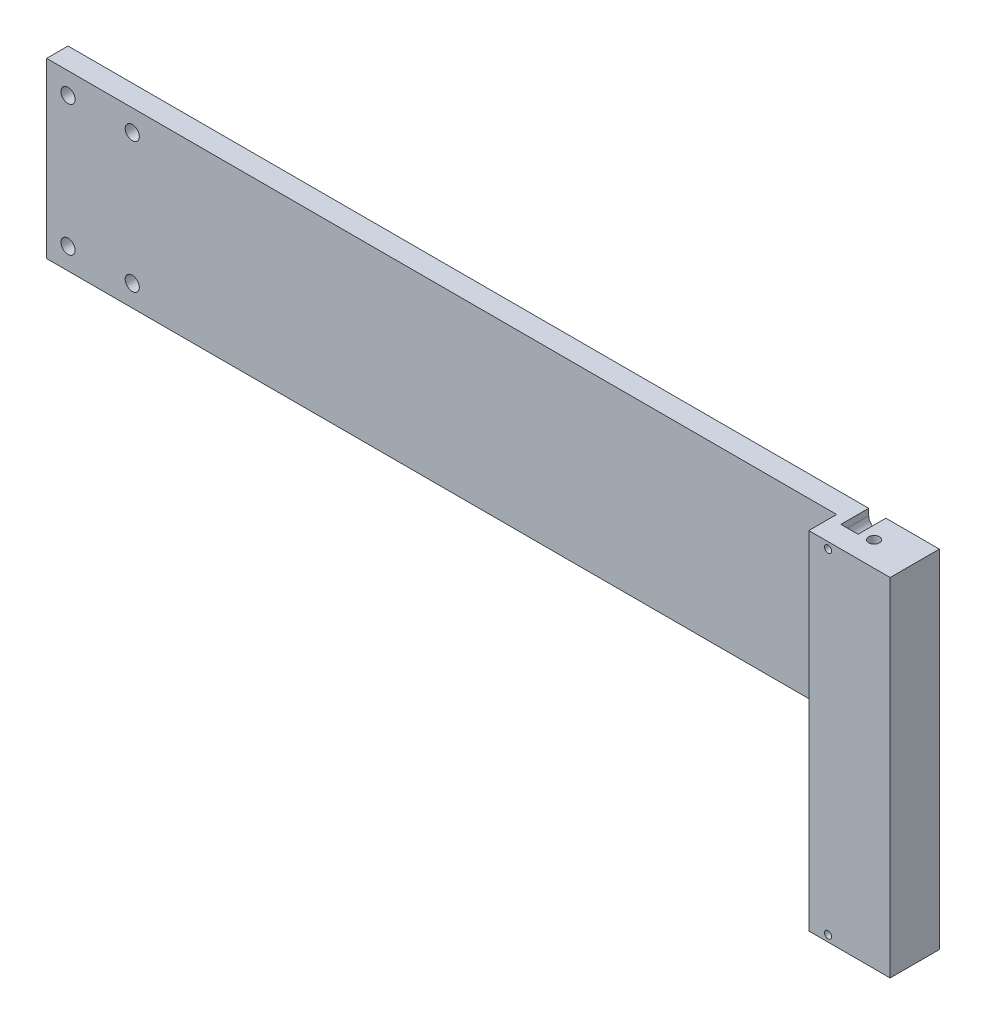
ISO-10303-21;
HEADER;
FILE_DESCRIPTION(('STEP AP214'),'2;1');
FILE_NAME('part.step','',(''),(''),'','','');
FILE_SCHEMA(('AUTOMOTIVE_DESIGN { 1 0 10303 214 1 1 1 1 }'));
ENDSEC;
DATA;
#1=APPLICATION_CONTEXT('core data for automotive mechanical design processes');
#2=APPLICATION_PROTOCOL_DEFINITION('international standard','automotive_design',2000,#1);
#3=PRODUCT_CONTEXT('',#1,'mechanical');
#4=PRODUCT('Part','Part','',(#3));
#5=PRODUCT_RELATED_PRODUCT_CATEGORY('part','',(#4));
#6=PRODUCT_DEFINITION_FORMATION('','',#4);
#7=PRODUCT_DEFINITION_CONTEXT('part definition',#1,'design');
#8=PRODUCT_DEFINITION('design','',#6,#7);
#9=PRODUCT_DEFINITION_SHAPE('','',#8);
#10=(LENGTH_UNIT() NAMED_UNIT(*) SI_UNIT(.MILLI.,.METRE.));
#11=(NAMED_UNIT(*) PLANE_ANGLE_UNIT() SI_UNIT($,.RADIAN.));
#12=(NAMED_UNIT(*) SI_UNIT($,.STERADIAN.) SOLID_ANGLE_UNIT());
#13=UNCERTAINTY_MEASURE_WITH_UNIT(LENGTH_MEASURE(1.E-05),#10,'distance_accuracy_value','');
#14=(GEOMETRIC_REPRESENTATION_CONTEXT(3) GLOBAL_UNCERTAINTY_ASSIGNED_CONTEXT((#13)) GLOBAL_UNIT_ASSIGNED_CONTEXT((#10,
#11,#12)) REPRESENTATION_CONTEXT('',''));
#15=CARTESIAN_POINT('',(0.,0.,0.));
#16=DIRECTION('',(0.,0.,1.));
#17=DIRECTION('',(1.,0.,0.));
#18=AXIS2_PLACEMENT_3D('',#15,#16,#17);
#19=CARTESIAN_POINT('',(378.,78.,23.));
#20=DIRECTION('',(0.,0.,-1.));
#21=DIRECTION('',(-1.,0.,0.));
#22=AXIS2_PLACEMENT_3D('',#19,#20,#21);
#23=CYLINDRICAL_SURFACE('',#22,1.64999999999999);
#24=CARTESIAN_POINT('',(378.,78.,23.));
#25=DIRECTION('',(0.,0.,-1.));
#26=DIRECTION('',(-1.,0.,0.));
#27=AXIS2_PLACEMENT_3D('',#24,#25,#26);
#28=CIRCLE('',#27,1.64999999999999);
#29=CARTESIAN_POINT('',(376.35,78.,23.));
#30=VERTEX_POINT('',#29);
#31=EDGE_CURVE('E228',#30,#30,#28,.T.);
#32=ORIENTED_EDGE('',*,*,#31,.F.);
#33=EDGE_LOOP('',(#32));
#34=FACE_BOUND('',#33,.T.);
#35=CARTESIAN_POINT('',(378.,78.,13.));
#36=DIRECTION('',(0.,0.,-1.));
#37=DIRECTION('',(-1.,0.,0.));
#38=AXIS2_PLACEMENT_3D('',#35,#36,#37);
#39=CIRCLE('',#38,1.64999999999999);
#40=CARTESIAN_POINT('',(376.35,78.,13.));
#41=VERTEX_POINT('',#40);
#42=EDGE_CURVE('E57',#41,#41,#39,.F.);
#43=ORIENTED_EDGE('',*,*,#42,.F.);
#44=EDGE_LOOP('',(#43));
#45=FACE_BOUND('',#44,.T.);
#46=ADVANCED_FACE('F53',(#34,#45),#23,.F.);
#47=CARTESIAN_POINT('',(378.,-78.,23.));
#48=DIRECTION('',(0.,0.,-1.));
#49=DIRECTION('',(-1.,0.,0.));
#50=AXIS2_PLACEMENT_3D('',#47,#48,#49);
#51=CYLINDRICAL_SURFACE('',#50,1.64999999999999);
#52=CARTESIAN_POINT('',(378.,-78.,23.));
#53=DIRECTION('',(0.,0.,-1.));
#54=DIRECTION('',(-1.,0.,0.));
#55=AXIS2_PLACEMENT_3D('',#52,#53,#54);
#56=CIRCLE('',#55,1.64999999999999);
#57=CARTESIAN_POINT('',(376.35,-78.,23.));
#58=VERTEX_POINT('',#57);
#59=EDGE_CURVE('E224',#58,#58,#56,.T.);
#60=ORIENTED_EDGE('',*,*,#59,.F.);
#61=EDGE_LOOP('',(#60));
#62=FACE_BOUND('',#61,.T.);
#63=CARTESIAN_POINT('',(378.,-78.,13.));
#64=DIRECTION('',(0.,0.,-1.));
#65=DIRECTION('',(-1.,0.,0.));
#66=AXIS2_PLACEMENT_3D('',#63,#64,#65);
#67=CIRCLE('',#66,1.64999999999999);
#68=CARTESIAN_POINT('',(376.35,-78.,13.));
#69=VERTEX_POINT('',#68);
#70=EDGE_CURVE('E195',#69,#69,#67,.F.);
#71=ORIENTED_EDGE('',*,*,#70,.F.);
#72=EDGE_LOOP('',(#71));
#73=FACE_BOUND('',#72,.T.);
#74=ADVANCED_FACE('F321',(#62,#73),#51,.F.);
#75=CARTESIAN_POINT('',(0.,0.,10.));
#76=DIRECTION('',(1.,0.,0.));
#77=DIRECTION('',(0.,0.,-1.));
#78=AXIS2_PLACEMENT_3D('',#75,#76,#77);
#79=PLANE('',#78);
#80=DIRECTION('',(0.,-1.,0.));
#81=VECTOR('',#80,1.);
#82=CARTESIAN_POINT('',(0.,0.,0.));
#83=LINE('',#82,#81);
#84=CARTESIAN_POINT('',(0.,81.,0.));
#85=VERTEX_POINT('',#84);
#86=CARTESIAN_POINT('',(0.,0.,0.));
#87=VERTEX_POINT('',#86);
#88=EDGE_CURVE('E291',#85,#87,#83,.T.);
#89=ORIENTED_EDGE('',*,*,#88,.T.);
#90=DIRECTION('',(0.,0.,-1.));
#91=VECTOR('',#90,1.);
#92=CARTESIAN_POINT('',(0.,0.,10.));
#93=LINE('',#92,#91);
#94=CARTESIAN_POINT('',(0.,0.,10.));
#95=VERTEX_POINT('',#94);
#96=EDGE_CURVE('E13',#95,#87,#93,.T.);
#97=ORIENTED_EDGE('',*,*,#96,.F.);
#98=DIRECTION('',(0.,-1.,0.));
#99=VECTOR('',#98,1.);
#100=CARTESIAN_POINT('',(0.,0.,10.));
#101=LINE('',#100,#99);
#102=CARTESIAN_POINT('',(0.,81.,10.));
#103=VERTEX_POINT('',#102);
#104=EDGE_CURVE('E292',#103,#95,#101,.T.);
#105=ORIENTED_EDGE('',*,*,#104,.F.);
#106=DIRECTION('',(0.,0.,-1.));
#107=VECTOR('',#106,1.);
#108=CARTESIAN_POINT('',(0.,81.,10.));
#109=LINE('',#108,#107);
#110=EDGE_CURVE('E302',#103,#85,#109,.T.);
#111=ORIENTED_EDGE('',*,*,#110,.T.);
#112=EDGE_LOOP('',(#89,#97,#105,#111));
#113=FACE_BOUND('',#112,.T.);
#114=ADVANCED_FACE('F55',(#113),#79,.F.);
#115=CARTESIAN_POINT('',(0.,0.,10.));
#116=DIRECTION('',(0.,1.,0.));
#117=DIRECTION('',(0.,0.,1.));
#118=AXIS2_PLACEMENT_3D('',#115,#116,#117);
#119=PLANE('',#118);
#120=DIRECTION('',(1.,0.,0.));
#121=VECTOR('',#120,1.);
#122=CARTESIAN_POINT('',(0.,0.,0.));
#123=LINE('',#122,#121);
#124=CARTESIAN_POINT('',(369.,0.,0.));
#125=VERTEX_POINT('',#124);
#126=EDGE_CURVE('E305',#87,#125,#123,.T.);
#127=ORIENTED_EDGE('',*,*,#126,.T.);
#128=DIRECTION('',(0.,0.,-1.));
#129=VECTOR('',#128,1.);
#130=CARTESIAN_POINT('',(369.,0.,10.));
#131=LINE('',#130,#129);
#132=CARTESIAN_POINT('',(369.,0.,10.));
#133=VERTEX_POINT('',#132);
#134=EDGE_CURVE('E62',#133,#125,#131,.T.);
#135=ORIENTED_EDGE('',*,*,#134,.F.);
#136=DIRECTION('',(1.,0.,0.));
#137=VECTOR('',#136,1.);
#138=CARTESIAN_POINT('',(0.,0.,10.));
#139=LINE('',#138,#137);
#140=EDGE_CURVE('E295',#95,#133,#139,.T.);
#141=ORIENTED_EDGE('',*,*,#140,.F.);
#142=ORIENTED_EDGE('',*,*,#96,.T.);
#143=EDGE_LOOP('',(#127,#135,#141,#142));
#144=FACE_BOUND('',#143,.T.);
#145=ADVANCED_FACE('F378',(#144),#119,.F.);
#146=CARTESIAN_POINT('',(0.,81.,10.));
#147=DIRECTION('',(0.,-1.,0.));
#148=DIRECTION('',(0.,0.,-1.));
#149=AXIS2_PLACEMENT_3D('',#146,#147,#148);
#150=PLANE('',#149);
#151=DIRECTION('',(-1.,0.,0.));
#152=VECTOR('',#151,1.);
#153=CARTESIAN_POINT('',(0.,81.,0.));
#154=LINE('',#153,#152);
#155=CARTESIAN_POINT('',(407.,81.,0.));
#156=VERTEX_POINT('',#155);
#157=CARTESIAN_POINT('',(382.,81.,0.));
#158=VERTEX_POINT('',#157);
#159=EDGE_CURVE('E296',#156,#158,#154,.T.);
#160=ORIENTED_EDGE('',*,*,#159,.T.);
#161=DIRECTION('',(0.,0.,-1.));
#162=VECTOR('',#161,1.);
#163=CARTESIAN_POINT('',(382.,81.,13.));
#164=LINE('',#163,#162);
#165=CARTESIAN_POINT('',(382.,81.,13.));
#166=VERTEX_POINT('',#165);
#167=EDGE_CURVE('E218',#166,#158,#164,.T.);
#168=ORIENTED_EDGE('',*,*,#167,.F.);
#169=DIRECTION('',(1.,0.,0.));
#170=VECTOR('',#169,1.);
#171=CARTESIAN_POINT('',(374.,81.,13.));
#172=LINE('',#171,#170);
#173=CARTESIAN_POINT('',(374.,81.,13.));
#174=VERTEX_POINT('',#173);
#175=EDGE_CURVE('E206',#174,#166,#172,.T.);
#176=ORIENTED_EDGE('',*,*,#175,.F.);
#177=DIRECTION('',(0.,0.,-1.));
#178=VECTOR('',#177,1.);
#179=CARTESIAN_POINT('',(374.,81.,13.));
#180=LINE('',#179,#178);
#181=CARTESIAN_POINT('',(374.,81.,0.));
#182=VERTEX_POINT('',#181);
#183=EDGE_CURVE('E220',#174,#182,#180,.T.);
#184=ORIENTED_EDGE('',*,*,#183,.T.);
#185=EDGE_CURVE('E307',#182,#85,#154,.T.);
#186=ORIENTED_EDGE('',*,*,#185,.T.);
#187=ORIENTED_EDGE('',*,*,#110,.F.);
#188=DIRECTION('',(-1.,0.,0.));
#189=VECTOR('',#188,1.);
#190=CARTESIAN_POINT('',(0.,81.,10.));
#191=LINE('',#190,#189);
#192=CARTESIAN_POINT('',(369.,81.,10.));
#193=VERTEX_POINT('',#192);
#194=EDGE_CURVE('E300',#193,#103,#191,.T.);
#195=ORIENTED_EDGE('',*,*,#194,.F.);
#196=DIRECTION('',(0.,0.,1.));
#197=VECTOR('',#196,1.);
#198=CARTESIAN_POINT('',(369.,81.,23.));
#199=LINE('',#198,#197);
#200=CARTESIAN_POINT('',(369.,81.,23.));
#201=VERTEX_POINT('',#200);
#202=EDGE_CURVE('E265',#193,#201,#199,.T.);
#203=ORIENTED_EDGE('',*,*,#202,.T.);
#204=DIRECTION('',(-1.,0.,0.));
#205=VECTOR('',#204,1.);
#206=CARTESIAN_POINT('',(407.,81.,23.));
#207=LINE('',#206,#205);
#208=CARTESIAN_POINT('',(407.,81.,23.));
#209=VERTEX_POINT('',#208);
#210=EDGE_CURVE('E272',#209,#201,#207,.T.);
#211=ORIENTED_EDGE('',*,*,#210,.F.);
#212=DIRECTION('',(0.,0.,1.));
#213=VECTOR('',#212,1.);
#214=CARTESIAN_POINT('',(407.,81.,23.));
#215=LINE('',#214,#213);
#216=EDGE_CURVE('E270',#156,#209,#215,.T.);
#217=ORIENTED_EDGE('',*,*,#216,.F.);
#218=EDGE_LOOP('',(#160,#168,#176,#184,#186,#187,#195,#203,#211,#217));
#219=FACE_BOUND('',#218,.T.);
#220=CARTESIAN_POINT('',(388.,81.,11.5));
#221=DIRECTION('',(0.,1.,0.));
#222=DIRECTION('',(0.,0.,1.));
#223=AXIS2_PLACEMENT_3D('',#220,#221,#222);
#224=CIRCLE('',#223,2.50000000000002);
#225=CARTESIAN_POINT('',(388.,81.,14.));
#226=VERTEX_POINT('',#225);
#227=EDGE_CURVE('E227',#226,#226,#224,.T.);
#228=ORIENTED_EDGE('',*,*,#227,.F.);
#229=EDGE_LOOP('',(#228));
#230=FACE_BOUND('',#229,.T.);
#231=ADVANCED_FACE('F372',(#219,#230),#150,.F.);
#232=CARTESIAN_POINT('',(0.,0.,10.));
#233=DIRECTION('',(0.,0.,-1.));
#234=DIRECTION('',(-1.,0.,0.));
#235=AXIS2_PLACEMENT_3D('',#232,#233,#234);
#236=PLANE('',#235);
#237=CARTESIAN_POINT('',(40.,71.,10.));
#238=DIRECTION('',(0.,0.,-1.));
#239=DIRECTION('',(-1.,0.,0.));
#240=AXIS2_PLACEMENT_3D('',#237,#238,#239);
#241=CIRCLE('',#240,3.3);
#242=CARTESIAN_POINT('',(36.7,71.,10.));
#243=VERTEX_POINT('',#242);
#244=EDGE_CURVE('E257',#243,#243,#241,.T.);
#245=ORIENTED_EDGE('',*,*,#244,.T.);
#246=EDGE_LOOP('',(#245));
#247=FACE_BOUND('',#246,.T.);
#248=CARTESIAN_POINT('',(40.,10.,10.));
#249=DIRECTION('',(0.,0.,-1.));
#250=DIRECTION('',(-1.,0.,0.));
#251=AXIS2_PLACEMENT_3D('',#248,#249,#250);
#252=CIRCLE('',#251,3.3);
#253=CARTESIAN_POINT('',(36.7,10.,10.));
#254=VERTEX_POINT('',#253);
#255=EDGE_CURVE('E254',#254,#254,#252,.T.);
#256=ORIENTED_EDGE('',*,*,#255,.T.);
#257=EDGE_LOOP('',(#256));
#258=FACE_BOUND('',#257,.T.);
#259=CARTESIAN_POINT('',(10.,10.,10.));
#260=DIRECTION('',(0.,0.,-1.));
#261=DIRECTION('',(-1.,0.,0.));
#262=AXIS2_PLACEMENT_3D('',#259,#260,#261);
#263=CIRCLE('',#262,3.3);
#264=CARTESIAN_POINT('',(6.70000000000001,10.,10.));
#265=VERTEX_POINT('',#264);
#266=EDGE_CURVE('E251',#265,#265,#263,.T.);
#267=ORIENTED_EDGE('',*,*,#266,.T.);
#268=EDGE_LOOP('',(#267));
#269=FACE_BOUND('',#268,.T.);
#270=CARTESIAN_POINT('',(10.,71.,10.));
#271=DIRECTION('',(0.,0.,-1.));
#272=DIRECTION('',(-1.,0.,0.));
#273=AXIS2_PLACEMENT_3D('',#270,#271,#272);
#274=CIRCLE('',#273,3.3);
#275=CARTESIAN_POINT('',(6.70000000000001,71.,10.));
#276=VERTEX_POINT('',#275);
#277=EDGE_CURVE('E248',#276,#276,#274,.T.);
#278=ORIENTED_EDGE('',*,*,#277,.T.);
#279=EDGE_LOOP('',(#278));
#280=FACE_BOUND('',#279,.T.);
#281=ORIENTED_EDGE('',*,*,#104,.T.);
#282=ORIENTED_EDGE('',*,*,#140,.T.);
#283=DIRECTION('',(0.,1.,0.));
#284=VECTOR('',#283,1.);
#285=CARTESIAN_POINT('',(369.,0.,10.));
#286=LINE('',#285,#284);
#287=EDGE_CURVE('E298',#133,#193,#286,.T.);
#288=ORIENTED_EDGE('',*,*,#287,.T.);
#289=ORIENTED_EDGE('',*,*,#194,.T.);
#290=EDGE_LOOP('',(#281,#282,#288,#289));
#291=FACE_BOUND('',#290,.T.);
#292=ADVANCED_FACE('F369',(#247,#258,#269,#280,#291),#236,.F.);
#293=CARTESIAN_POINT('',(0.,0.,0.));
#294=DIRECTION('',(0.,0.,-1.));
#295=DIRECTION('',(-1.,0.,0.));
#296=AXIS2_PLACEMENT_3D('',#293,#294,#295);
#297=PLANE('',#296);
#298=DIRECTION('',(0.,1.,0.));
#299=VECTOR('',#298,1.);
#300=CARTESIAN_POINT('',(374.,-81.,0.));
#301=LINE('',#300,#299);
#302=CARTESIAN_POINT('',(374.,-81.,0.));
#303=VERTEX_POINT('',#302);
#304=CARTESIAN_POINT('',(374.,-78.,0.));
#305=VERTEX_POINT('',#304);
#306=EDGE_CURVE('E182',#303,#305,#301,.T.);
#307=ORIENTED_EDGE('',*,*,#306,.F.);
#308=DIRECTION('',(-1.,0.,0.));
#309=VECTOR('',#308,1.);
#310=CARTESIAN_POINT('',(407.,-81.,0.));
#311=LINE('',#310,#309);
#312=CARTESIAN_POINT('',(369.,-81.,0.));
#313=VERTEX_POINT('',#312);
#314=EDGE_CURVE('E284',#303,#313,#311,.T.);
#315=ORIENTED_EDGE('',*,*,#314,.T.);
#316=DIRECTION('',(0.,1.,0.));
#317=VECTOR('',#316,1.);
#318=CARTESIAN_POINT('',(369.,81.,0.));
#319=LINE('',#318,#317);
#320=EDGE_CURVE('E278',#313,#125,#319,.T.);
#321=ORIENTED_EDGE('',*,*,#320,.T.);
#322=ORIENTED_EDGE('',*,*,#126,.F.);
#323=ORIENTED_EDGE('',*,*,#88,.F.);
#324=ORIENTED_EDGE('',*,*,#185,.F.);
#325=DIRECTION('',(0.,1.,0.));
#326=VECTOR('',#325,1.);
#327=CARTESIAN_POINT('',(374.,78.,0.));
#328=LINE('',#327,#326);
#329=CARTESIAN_POINT('',(374.,78.,0.));
#330=VERTEX_POINT('',#329);
#331=EDGE_CURVE('E213',#330,#182,#328,.T.);
#332=ORIENTED_EDGE('',*,*,#331,.F.);
#333=CARTESIAN_POINT('',(378.,78.,0.));
#334=DIRECTION('',(0.,0.,-1.));
#335=DIRECTION('',(-1.,0.,0.));
#336=AXIS2_PLACEMENT_3D('',#333,#334,#335);
#337=CIRCLE('',#336,4.);
#338=CARTESIAN_POINT('',(382.,78.,0.));
#339=VERTEX_POINT('',#338);
#340=EDGE_CURVE('E70',#339,#330,#337,.T.);
#341=ORIENTED_EDGE('',*,*,#340,.F.);
#342=DIRECTION('',(0.,-1.,0.));
#343=VECTOR('',#342,1.);
#344=CARTESIAN_POINT('',(382.,81.,0.));
#345=LINE('',#344,#343);
#346=EDGE_CURVE('E203',#158,#339,#345,.T.);
#347=ORIENTED_EDGE('',*,*,#346,.F.);
#348=ORIENTED_EDGE('',*,*,#159,.F.);
#349=DIRECTION('',(0.,1.,0.));
#350=VECTOR('',#349,1.);
#351=CARTESIAN_POINT('',(407.,81.,0.));
#352=LINE('',#351,#350);
#353=CARTESIAN_POINT('',(407.,-81.,0.));
#354=VERTEX_POINT('',#353);
#355=EDGE_CURVE('E267',#354,#156,#352,.T.);
#356=ORIENTED_EDGE('',*,*,#355,.F.);
#357=CARTESIAN_POINT('',(382.,-81.,0.));
#358=VERTEX_POINT('',#357);
#359=EDGE_CURVE('E285',#354,#358,#311,.T.);
#360=ORIENTED_EDGE('',*,*,#359,.T.);
#361=DIRECTION('',(0.,-1.,0.));
#362=VECTOR('',#361,1.);
#363=CARTESIAN_POINT('',(382.,-78.,0.));
#364=LINE('',#363,#362);
#365=CARTESIAN_POINT('',(382.,-78.,0.));
#366=VERTEX_POINT('',#365);
#367=EDGE_CURVE('E185',#366,#358,#364,.T.);
#368=ORIENTED_EDGE('',*,*,#367,.F.);
#369=CARTESIAN_POINT('',(378.,-78.,0.));
#370=DIRECTION('',(0.,0.,-1.));
#371=DIRECTION('',(-1.,0.,0.));
#372=AXIS2_PLACEMENT_3D('',#369,#370,#371);
#373=CIRCLE('',#372,4.);
#374=EDGE_CURVE('E168',#305,#366,#373,.T.);
#375=ORIENTED_EDGE('',*,*,#374,.F.);
#376=EDGE_LOOP('',(#307,#315,#321,#322,#323,#324,#332,#341,#347,#348,#356,#360,#368,#375));
#377=FACE_BOUND('',#376,.T.);
#378=CARTESIAN_POINT('',(40.,71.,0.));
#379=DIRECTION('',(0.,0.,-1.));
#380=DIRECTION('',(-1.,0.,0.));
#381=AXIS2_PLACEMENT_3D('',#378,#379,#380);
#382=CIRCLE('',#381,3.3);
#383=CARTESIAN_POINT('',(36.7,71.,0.));
#384=VERTEX_POINT('',#383);
#385=EDGE_CURVE('E234',#384,#384,#382,.T.);
#386=ORIENTED_EDGE('',*,*,#385,.F.);
#387=EDGE_LOOP('',(#386));
#388=FACE_BOUND('',#387,.T.);
#389=CARTESIAN_POINT('',(40.,10.,0.));
#390=DIRECTION('',(0.,0.,-1.));
#391=DIRECTION('',(-1.,0.,0.));
#392=AXIS2_PLACEMENT_3D('',#389,#390,#391);
#393=CIRCLE('',#392,3.3);
#394=CARTESIAN_POINT('',(36.7,10.,0.));
#395=VERTEX_POINT('',#394);
#396=EDGE_CURVE('E241',#395,#395,#393,.T.);
#397=ORIENTED_EDGE('',*,*,#396,.F.);
#398=EDGE_LOOP('',(#397));
#399=FACE_BOUND('',#398,.T.);
#400=CARTESIAN_POINT('',(10.,10.,0.));
#401=DIRECTION('',(0.,0.,-1.));
#402=DIRECTION('',(-1.,0.,0.));
#403=AXIS2_PLACEMENT_3D('',#400,#401,#402);
#404=CIRCLE('',#403,3.3);
#405=CARTESIAN_POINT('',(6.70000000000001,10.,0.));
#406=VERTEX_POINT('',#405);
#407=EDGE_CURVE('E237',#406,#406,#404,.T.);
#408=ORIENTED_EDGE('',*,*,#407,.F.);
#409=EDGE_LOOP('',(#408));
#410=FACE_BOUND('',#409,.T.);
#411=CARTESIAN_POINT('',(10.,71.,0.));
#412=DIRECTION('',(0.,0.,-1.));
#413=DIRECTION('',(-1.,0.,0.));
#414=AXIS2_PLACEMENT_3D('',#411,#412,#413);
#415=CIRCLE('',#414,3.3);
#416=CARTESIAN_POINT('',(6.70000000000001,71.,0.));
#417=VERTEX_POINT('',#416);
#418=EDGE_CURVE('E240',#417,#417,#415,.T.);
#419=ORIENTED_EDGE('',*,*,#418,.F.);
#420=EDGE_LOOP('',(#419));
#421=FACE_BOUND('',#420,.T.);
#422=ADVANCED_FACE('F367',(#377,#388,#399,#410,#421),#297,.T.);
#423=CARTESIAN_POINT('',(407.,81.,23.));
#424=DIRECTION('',(0.,0.,-1.));
#425=DIRECTION('',(-1.,0.,0.));
#426=AXIS2_PLACEMENT_3D('',#423,#424,#425);
#427=PLANE('',#426);
#428=ORIENTED_EDGE('',*,*,#59,.T.);
#429=EDGE_LOOP('',(#428));
#430=FACE_BOUND('',#429,.T.);
#431=ORIENTED_EDGE('',*,*,#31,.T.);
#432=EDGE_LOOP('',(#431));
#433=FACE_BOUND('',#432,.T.);
#434=DIRECTION('',(0.,-1.,0.));
#435=VECTOR('',#434,1.);
#436=CARTESIAN_POINT('',(369.,81.,23.));
#437=LINE('',#436,#435);
#438=CARTESIAN_POINT('',(369.,-81.,23.));
#439=VERTEX_POINT('',#438);
#440=EDGE_CURVE('E260',#201,#439,#437,.T.);
#441=ORIENTED_EDGE('',*,*,#440,.T.);
#442=DIRECTION('',(-1.,0.,0.));
#443=VECTOR('',#442,1.);
#444=CARTESIAN_POINT('',(407.,-81.,23.));
#445=LINE('',#444,#443);
#446=CARTESIAN_POINT('',(407.,-81.,23.));
#447=VERTEX_POINT('',#446);
#448=EDGE_CURVE('E288',#447,#439,#445,.T.);
#449=ORIENTED_EDGE('',*,*,#448,.F.);
#450=DIRECTION('',(0.,-1.,0.));
#451=VECTOR('',#450,1.);
#452=CARTESIAN_POINT('',(407.,81.,23.));
#453=LINE('',#452,#451);
#454=EDGE_CURVE('E261',#209,#447,#453,.T.);
#455=ORIENTED_EDGE('',*,*,#454,.F.);
#456=ORIENTED_EDGE('',*,*,#210,.T.);
#457=EDGE_LOOP('',(#441,#449,#455,#456));
#458=FACE_BOUND('',#457,.T.);
#459=ADVANCED_FACE('F363',(#430,#433,#458),#427,.F.);
#460=CARTESIAN_POINT('',(407.,-81.,23.));
#461=DIRECTION('',(0.,1.,0.));
#462=DIRECTION('',(0.,0.,1.));
#463=AXIS2_PLACEMENT_3D('',#460,#461,#462);
#464=PLANE('',#463);
#465=ORIENTED_EDGE('',*,*,#314,.F.);
#466=DIRECTION('',(0.,0.,-1.));
#467=VECTOR('',#466,1.);
#468=CARTESIAN_POINT('',(374.,-81.,13.));
#469=LINE('',#468,#467);
#470=CARTESIAN_POINT('',(374.,-81.,13.));
#471=VERTEX_POINT('',#470);
#472=EDGE_CURVE('E196',#471,#303,#469,.T.);
#473=ORIENTED_EDGE('',*,*,#472,.F.);
#474=DIRECTION('',(-1.,0.,0.));
#475=VECTOR('',#474,1.);
#476=CARTESIAN_POINT('',(382.,-81.,13.));
#477=LINE('',#476,#475);
#478=CARTESIAN_POINT('',(382.,-81.,13.));
#479=VERTEX_POINT('',#478);
#480=EDGE_CURVE('E177',#479,#471,#477,.T.);
#481=ORIENTED_EDGE('',*,*,#480,.F.);
#482=DIRECTION('',(0.,0.,-1.));
#483=VECTOR('',#482,1.);
#484=CARTESIAN_POINT('',(382.,-81.,13.));
#485=LINE('',#484,#483);
#486=EDGE_CURVE('E171',#479,#358,#485,.T.);
#487=ORIENTED_EDGE('',*,*,#486,.T.);
#488=ORIENTED_EDGE('',*,*,#359,.F.);
#489=DIRECTION('',(0.,0.,-1.));
#490=VECTOR('',#489,1.);
#491=CARTESIAN_POINT('',(407.,-81.,23.));
#492=LINE('',#491,#490);
#493=EDGE_CURVE('E264',#447,#354,#492,.T.);
#494=ORIENTED_EDGE('',*,*,#493,.F.);
#495=ORIENTED_EDGE('',*,*,#448,.T.);
#496=DIRECTION('',(0.,0.,-1.));
#497=VECTOR('',#496,1.);
#498=CARTESIAN_POINT('',(369.,-81.,23.));
#499=LINE('',#498,#497);
#500=EDGE_CURVE('E275',#439,#313,#499,.T.);
#501=ORIENTED_EDGE('',*,*,#500,.T.);
#502=EDGE_LOOP('',(#465,#473,#481,#487,#488,#494,#495,#501));
#503=FACE_BOUND('',#502,.T.);
#504=CARTESIAN_POINT('',(388.,-81.,11.5));
#505=DIRECTION('',(0.,1.,0.));
#506=DIRECTION('',(0.,0.,1.));
#507=AXIS2_PLACEMENT_3D('',#504,#505,#506);
#508=CIRCLE('',#507,2.50000000000002);
#509=CARTESIAN_POINT('',(388.,-81.,14.));
#510=VERTEX_POINT('',#509);
#511=EDGE_CURVE('E231',#510,#510,#508,.T.);
#512=ORIENTED_EDGE('',*,*,#511,.T.);
#513=EDGE_LOOP('',(#512));
#514=FACE_BOUND('',#513,.T.);
#515=ADVANCED_FACE('F356',(#503,#514),#464,.F.);
#516=CARTESIAN_POINT('',(407.,0.,0.));
#517=DIRECTION('',(1.,0.,0.));
#518=DIRECTION('',(0.,0.,-1.));
#519=AXIS2_PLACEMENT_3D('',#516,#517,#518);
#520=PLANE('',#519);
#521=ORIENTED_EDGE('',*,*,#454,.T.);
#522=ORIENTED_EDGE('',*,*,#493,.T.);
#523=ORIENTED_EDGE('',*,*,#355,.T.);
#524=ORIENTED_EDGE('',*,*,#216,.T.);
#525=EDGE_LOOP('',(#521,#522,#523,#524));
#526=FACE_BOUND('',#525,.T.);
#527=ADVANCED_FACE('F353',(#526),#520,.T.);
#528=CARTESIAN_POINT('',(369.,0.,0.));
#529=DIRECTION('',(1.,0.,0.));
#530=DIRECTION('',(0.,0.,-1.));
#531=AXIS2_PLACEMENT_3D('',#528,#529,#530);
#532=PLANE('',#531);
#533=ORIENTED_EDGE('',*,*,#287,.F.);
#534=ORIENTED_EDGE('',*,*,#134,.T.);
#535=ORIENTED_EDGE('',*,*,#320,.F.);
#536=ORIENTED_EDGE('',*,*,#500,.F.);
#537=ORIENTED_EDGE('',*,*,#440,.F.);
#538=ORIENTED_EDGE('',*,*,#202,.F.);
#539=EDGE_LOOP('',(#533,#534,#535,#536,#537,#538));
#540=FACE_BOUND('',#539,.T.);
#541=ADVANCED_FACE('F351',(#540),#532,.F.);
#542=CARTESIAN_POINT('',(10.,71.,13.));
#543=DIRECTION('',(0.,0.,-1.));
#544=DIRECTION('',(-1.,0.,0.));
#545=AXIS2_PLACEMENT_3D('',#542,#543,#544);
#546=CYLINDRICAL_SURFACE('',#545,3.3);
#547=ORIENTED_EDGE('',*,*,#418,.T.);
#548=EDGE_LOOP('',(#547));
#549=FACE_BOUND('',#548,.T.);
#550=ORIENTED_EDGE('',*,*,#277,.F.);
#551=EDGE_LOOP('',(#550));
#552=FACE_BOUND('',#551,.T.);
#553=ADVANCED_FACE('F341',(#549,#552),#546,.F.);
#554=CARTESIAN_POINT('',(10.,10.,13.));
#555=DIRECTION('',(0.,0.,-1.));
#556=DIRECTION('',(-1.,0.,0.));
#557=AXIS2_PLACEMENT_3D('',#554,#555,#556);
#558=CYLINDRICAL_SURFACE('',#557,3.3);
#559=ORIENTED_EDGE('',*,*,#407,.T.);
#560=EDGE_LOOP('',(#559));
#561=FACE_BOUND('',#560,.T.);
#562=ORIENTED_EDGE('',*,*,#266,.F.);
#563=EDGE_LOOP('',(#562));
#564=FACE_BOUND('',#563,.T.);
#565=ADVANCED_FACE('F337',(#561,#564),#558,.F.);
#566=CARTESIAN_POINT('',(40.,10.,13.));
#567=DIRECTION('',(0.,0.,-1.));
#568=DIRECTION('',(-1.,0.,0.));
#569=AXIS2_PLACEMENT_3D('',#566,#567,#568);
#570=CYLINDRICAL_SURFACE('',#569,3.3);
#571=ORIENTED_EDGE('',*,*,#396,.T.);
#572=EDGE_LOOP('',(#571));
#573=FACE_BOUND('',#572,.T.);
#574=ORIENTED_EDGE('',*,*,#255,.F.);
#575=EDGE_LOOP('',(#574));
#576=FACE_BOUND('',#575,.T.);
#577=ADVANCED_FACE('F340',(#573,#576),#570,.F.);
#578=CARTESIAN_POINT('',(40.,71.,13.));
#579=DIRECTION('',(0.,0.,-1.));
#580=DIRECTION('',(-1.,0.,0.));
#581=AXIS2_PLACEMENT_3D('',#578,#579,#580);
#582=CYLINDRICAL_SURFACE('',#581,3.3);
#583=ORIENTED_EDGE('',*,*,#385,.T.);
#584=EDGE_LOOP('',(#583));
#585=FACE_BOUND('',#584,.T.);
#586=ORIENTED_EDGE('',*,*,#244,.F.);
#587=EDGE_LOOP('',(#586));
#588=FACE_BOUND('',#587,.T.);
#589=ADVANCED_FACE('F335',(#585,#588),#582,.F.);
#590=CARTESIAN_POINT('',(388.,-81.,11.5));
#591=DIRECTION('',(0.,1.,0.));
#592=DIRECTION('',(0.,0.,1.));
#593=AXIS2_PLACEMENT_3D('',#590,#591,#592);
#594=CYLINDRICAL_SURFACE('',#593,2.50000000000002);
#595=ORIENTED_EDGE('',*,*,#511,.F.);
#596=EDGE_LOOP('',(#595));
#597=FACE_BOUND('',#596,.T.);
#598=ORIENTED_EDGE('',*,*,#227,.T.);
#599=EDGE_LOOP('',(#598));
#600=FACE_BOUND('',#599,.T.);
#601=ADVANCED_FACE('F332',(#597,#600),#594,.F.);
#602=CARTESIAN_POINT('',(378.,-78.,13.));
#603=DIRECTION('',(0.,0.,-1.));
#604=DIRECTION('',(-1.,0.,0.));
#605=AXIS2_PLACEMENT_3D('',#602,#603,#604);
#606=PLANE('',#605);
#607=CARTESIAN_POINT('',(378.,-78.,13.));
#608=DIRECTION('',(0.,0.,-1.));
#609=DIRECTION('',(-1.,0.,0.));
#610=AXIS2_PLACEMENT_3D('',#607,#608,#609);
#611=CIRCLE('',#610,4.);
#612=CARTESIAN_POINT('',(374.,-78.,13.));
#613=VERTEX_POINT('',#612);
#614=CARTESIAN_POINT('',(382.,-78.,13.));
#615=VERTEX_POINT('',#614);
#616=EDGE_CURVE('E165',#613,#615,#611,.T.);
#617=ORIENTED_EDGE('',*,*,#616,.T.);
#618=DIRECTION('',(0.,-1.,0.));
#619=VECTOR('',#618,1.);
#620=CARTESIAN_POINT('',(382.,-78.,13.));
#621=LINE('',#620,#619);
#622=EDGE_CURVE('E78',#615,#479,#621,.T.);
#623=ORIENTED_EDGE('',*,*,#622,.T.);
#624=ORIENTED_EDGE('',*,*,#480,.T.);
#625=DIRECTION('',(0.,1.,0.));
#626=VECTOR('',#625,1.);
#627=CARTESIAN_POINT('',(374.,-81.,13.));
#628=LINE('',#627,#626);
#629=EDGE_CURVE('E172',#471,#613,#628,.T.);
#630=ORIENTED_EDGE('',*,*,#629,.T.);
#631=EDGE_LOOP('',(#617,#623,#624,#630));
#632=FACE_BOUND('',#631,.T.);
#633=ORIENTED_EDGE('',*,*,#70,.T.);
#634=EDGE_LOOP('',(#633));
#635=FACE_BOUND('',#634,.T.);
#636=ADVANCED_FACE('F179',(#632,#635),#606,.T.);
#637=CARTESIAN_POINT('',(378.,-78.,13.));
#638=DIRECTION('',(0.,0.,-1.));
#639=DIRECTION('',(-1.,0.,0.));
#640=AXIS2_PLACEMENT_3D('',#637,#638,#639);
#641=CYLINDRICAL_SURFACE('',#640,4.);
#642=ORIENTED_EDGE('',*,*,#374,.T.);
#643=DIRECTION('',(0.,0.,-1.));
#644=VECTOR('',#643,1.);
#645=CARTESIAN_POINT('',(382.,-78.,13.));
#646=LINE('',#645,#644);
#647=EDGE_CURVE('E163',#615,#366,#646,.T.);
#648=ORIENTED_EDGE('',*,*,#647,.F.);
#649=ORIENTED_EDGE('',*,*,#616,.F.);
#650=DIRECTION('',(0.,0.,-1.));
#651=VECTOR('',#650,1.);
#652=CARTESIAN_POINT('',(374.,-78.,13.));
#653=LINE('',#652,#651);
#654=EDGE_CURVE('E193',#613,#305,#653,.T.);
#655=ORIENTED_EDGE('',*,*,#654,.T.);
#656=EDGE_LOOP('',(#642,#648,#649,#655));
#657=FACE_BOUND('',#656,.T.);
#658=ADVANCED_FACE('F164',(#657),#641,.F.);
#659=CARTESIAN_POINT('',(374.,-81.,13.));
#660=DIRECTION('',(-1.,0.,0.));
#661=DIRECTION('',(0.,0.,1.));
#662=AXIS2_PLACEMENT_3D('',#659,#660,#661);
#663=PLANE('',#662);
#664=ORIENTED_EDGE('',*,*,#306,.T.);
#665=ORIENTED_EDGE('',*,*,#654,.F.);
#666=ORIENTED_EDGE('',*,*,#629,.F.);
#667=ORIENTED_EDGE('',*,*,#472,.T.);
#668=EDGE_LOOP('',(#664,#665,#666,#667));
#669=FACE_BOUND('',#668,.T.);
#670=ADVANCED_FACE('F425',(#669),#663,.F.);
#671=CARTESIAN_POINT('',(382.,-78.,13.));
#672=DIRECTION('',(1.,0.,0.));
#673=DIRECTION('',(0.,0.,-1.));
#674=AXIS2_PLACEMENT_3D('',#671,#672,#673);
#675=PLANE('',#674);
#676=ORIENTED_EDGE('',*,*,#367,.T.);
#677=ORIENTED_EDGE('',*,*,#486,.F.);
#678=ORIENTED_EDGE('',*,*,#622,.F.);
#679=ORIENTED_EDGE('',*,*,#647,.T.);
#680=EDGE_LOOP('',(#676,#677,#678,#679));
#681=FACE_BOUND('',#680,.T.);
#682=ADVANCED_FACE('F174',(#681),#675,.F.);
#683=CARTESIAN_POINT('',(378.,78.,13.));
#684=DIRECTION('',(0.,0.,-1.));
#685=DIRECTION('',(-1.,0.,0.));
#686=AXIS2_PLACEMENT_3D('',#683,#684,#685);
#687=PLANE('',#686);
#688=CARTESIAN_POINT('',(378.,78.,13.));
#689=DIRECTION('',(0.,0.,-1.));
#690=DIRECTION('',(-1.,0.,0.));
#691=AXIS2_PLACEMENT_3D('',#688,#689,#690);
#692=CIRCLE('',#691,4.);
#693=CARTESIAN_POINT('',(382.,78.,13.));
#694=VERTEX_POINT('',#693);
#695=CARTESIAN_POINT('',(374.,78.,13.));
#696=VERTEX_POINT('',#695);
#697=EDGE_CURVE('E199',#694,#696,#692,.T.);
#698=ORIENTED_EDGE('',*,*,#697,.T.);
#699=DIRECTION('',(0.,1.,0.));
#700=VECTOR('',#699,1.);
#701=CARTESIAN_POINT('',(374.,78.,13.));
#702=LINE('',#701,#700);
#703=EDGE_CURVE('E202',#696,#174,#702,.T.);
#704=ORIENTED_EDGE('',*,*,#703,.T.);
#705=ORIENTED_EDGE('',*,*,#175,.T.);
#706=DIRECTION('',(0.,-1.,0.));
#707=VECTOR('',#706,1.);
#708=CARTESIAN_POINT('',(382.,81.,13.));
#709=LINE('',#708,#707);
#710=EDGE_CURVE('E208',#166,#694,#709,.T.);
#711=ORIENTED_EDGE('',*,*,#710,.T.);
#712=EDGE_LOOP('',(#698,#704,#705,#711));
#713=FACE_BOUND('',#712,.T.);
#714=ORIENTED_EDGE('',*,*,#42,.T.);
#715=EDGE_LOOP('',(#714));
#716=FACE_BOUND('',#715,.T.);
#717=ADVANCED_FACE('F318',(#713,#716),#687,.T.);
#718=CARTESIAN_POINT('',(378.,78.,13.));
#719=DIRECTION('',(0.,0.,-1.));
#720=DIRECTION('',(-1.,0.,0.));
#721=AXIS2_PLACEMENT_3D('',#718,#719,#720);
#722=CYLINDRICAL_SURFACE('',#721,4.);
#723=ORIENTED_EDGE('',*,*,#340,.T.);
#724=DIRECTION('',(0.,0.,-1.));
#725=VECTOR('',#724,1.);
#726=CARTESIAN_POINT('',(374.,78.,13.));
#727=LINE('',#726,#725);
#728=EDGE_CURVE('E211',#696,#330,#727,.T.);
#729=ORIENTED_EDGE('',*,*,#728,.F.);
#730=ORIENTED_EDGE('',*,*,#697,.F.);
#731=DIRECTION('',(0.,0.,-1.));
#732=VECTOR('',#731,1.);
#733=CARTESIAN_POINT('',(382.,78.,13.));
#734=LINE('',#733,#732);
#735=EDGE_CURVE('E191',#694,#339,#734,.T.);
#736=ORIENTED_EDGE('',*,*,#735,.T.);
#737=EDGE_LOOP('',(#723,#729,#730,#736));
#738=FACE_BOUND('',#737,.T.);
#739=ADVANCED_FACE('F418',(#738),#722,.F.);
#740=CARTESIAN_POINT('',(382.,81.,13.));
#741=DIRECTION('',(1.,0.,0.));
#742=DIRECTION('',(0.,0.,-1.));
#743=AXIS2_PLACEMENT_3D('',#740,#741,#742);
#744=PLANE('',#743);
#745=ORIENTED_EDGE('',*,*,#346,.T.);
#746=ORIENTED_EDGE('',*,*,#735,.F.);
#747=ORIENTED_EDGE('',*,*,#710,.F.);
#748=ORIENTED_EDGE('',*,*,#167,.T.);
#749=EDGE_LOOP('',(#745,#746,#747,#748));
#750=FACE_BOUND('',#749,.T.);
#751=ADVANCED_FACE('F421',(#750),#744,.F.);
#752=CARTESIAN_POINT('',(374.,78.,13.));
#753=DIRECTION('',(-1.,0.,0.));
#754=DIRECTION('',(0.,0.,1.));
#755=AXIS2_PLACEMENT_3D('',#752,#753,#754);
#756=PLANE('',#755);
#757=ORIENTED_EDGE('',*,*,#331,.T.);
#758=ORIENTED_EDGE('',*,*,#183,.F.);
#759=ORIENTED_EDGE('',*,*,#703,.F.);
#760=ORIENTED_EDGE('',*,*,#728,.T.);
#761=EDGE_LOOP('',(#757,#758,#759,#760));
#762=FACE_BOUND('',#761,.T.);
#763=ADVANCED_FACE('F414',(#762),#756,.F.);
#764=CLOSED_SHELL('',(#46,#74,#114,#145,#231,#292,#422,#459,#515,#527,#541,#553,#565,#577,#589,
#601,#636,#658,#670,#682,#717,#739,#751,#763));
#765=MANIFOLD_SOLID_BREP('B2',#764);
#766=ADVANCED_BREP_SHAPE_REPRESENTATION('',(#18,#765),#14);
#767=SHAPE_DEFINITION_REPRESENTATION(#9,#766);
ENDSEC;
END-ISO-10303-21;
